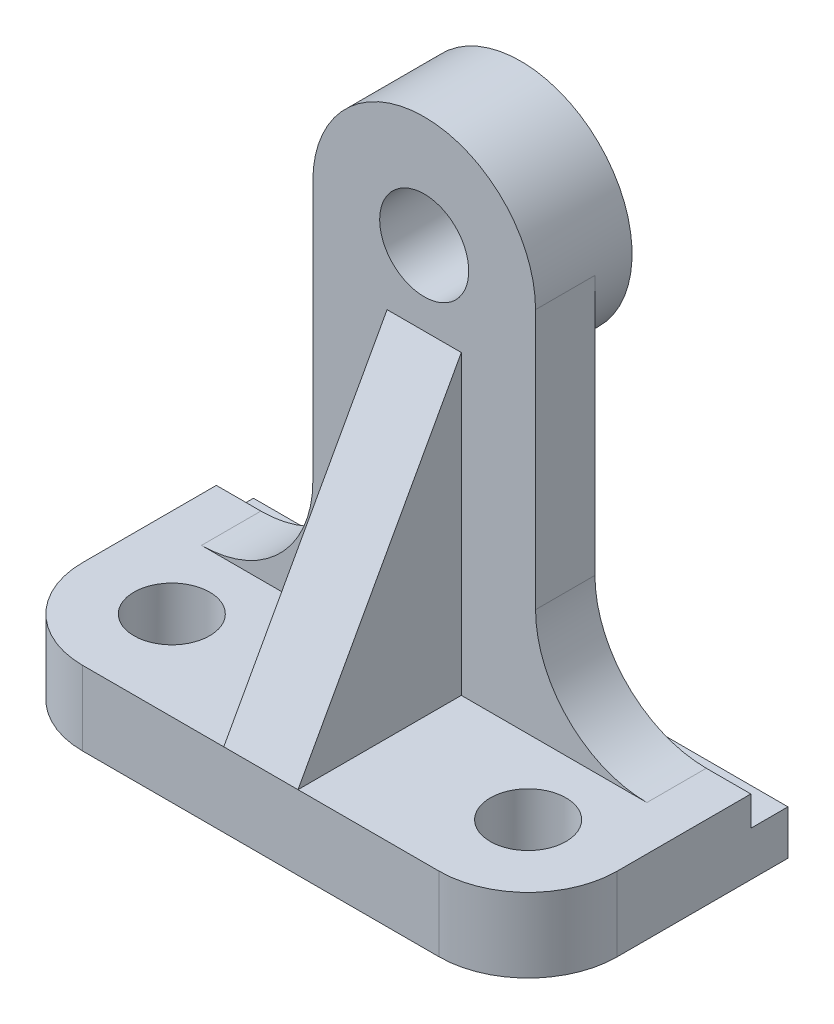
ISO-10303-21;
HEADER;
FILE_DESCRIPTION(('STEP AP214'),'2;1');
FILE_NAME('part.step','',(''),(''),'','','');
FILE_SCHEMA(('AUTOMOTIVE_DESIGN { 1 0 10303 214 1 1 1 1 }'));
ENDSEC;
DATA;
#1=APPLICATION_CONTEXT('core data for automotive mechanical design processes');
#2=APPLICATION_PROTOCOL_DEFINITION('international standard','automotive_design',2000,#1);
#3=PRODUCT_CONTEXT('',#1,'mechanical');
#4=PRODUCT('Part','Part','',(#3));
#5=PRODUCT_RELATED_PRODUCT_CATEGORY('part','',(#4));
#6=PRODUCT_DEFINITION_FORMATION('','',#4);
#7=PRODUCT_DEFINITION_CONTEXT('part definition',#1,'design');
#8=PRODUCT_DEFINITION('design','',#6,#7);
#9=PRODUCT_DEFINITION_SHAPE('','',#8);
#10=(LENGTH_UNIT() NAMED_UNIT(*) SI_UNIT(.MILLI.,.METRE.));
#11=(NAMED_UNIT(*) PLANE_ANGLE_UNIT() SI_UNIT($,.RADIAN.));
#12=(NAMED_UNIT(*) SI_UNIT($,.STERADIAN.) SOLID_ANGLE_UNIT());
#13=UNCERTAINTY_MEASURE_WITH_UNIT(LENGTH_MEASURE(1.E-05),#10,'distance_accuracy_value','');
#14=(GEOMETRIC_REPRESENTATION_CONTEXT(3) GLOBAL_UNCERTAINTY_ASSIGNED_CONTEXT((#13)) GLOBAL_UNIT_ASSIGNED_CONTEXT((#10,
#11,#12)) REPRESENTATION_CONTEXT('',''));
#15=CARTESIAN_POINT('',(0.,0.,0.));
#16=DIRECTION('',(0.,0.,1.));
#17=DIRECTION('',(1.,0.,0.));
#18=AXIS2_PLACEMENT_3D('',#15,#16,#17);
#19=CARTESIAN_POINT('',(0.,10.,0.));
#20=DIRECTION('',(0.,-1.,0.));
#21=DIRECTION('',(0.,0.,-1.));
#22=AXIS2_PLACEMENT_3D('',#19,#20,#21);
#23=PLANE('',#22);
#24=CARTESIAN_POINT('',(-24.,10.,5.50000000000001));
#25=DIRECTION('',(0.,1.,0.));
#26=DIRECTION('',(0.,0.,1.));
#27=AXIS2_PLACEMENT_3D('',#24,#25,#26);
#28=CIRCLE('',#27,5.09999999999999);
#29=CARTESIAN_POINT('',(-24.,10.,10.6));
#30=VERTEX_POINT('',#29);
#31=EDGE_CURVE('E414',#30,#30,#28,.T.);
#32=ORIENTED_EDGE('',*,*,#31,.F.);
#33=EDGE_LOOP('',(#32));
#34=FACE_BOUND('',#33,.T.);
#35=DIRECTION('',(0.,0.,1.));
#36=VECTOR('',#35,1.);
#37=CARTESIAN_POINT('',(-5.,10.,0.));
#38=LINE('',#37,#36);
#39=CARTESIAN_POINT('',(-5.,10.,-4.5));
#40=VERTEX_POINT('',#39);
#41=CARTESIAN_POINT('',(-5.,10.,17.5));
#42=VERTEX_POINT('',#41);
#43=EDGE_CURVE('E164',#40,#42,#38,.T.);
#44=ORIENTED_EDGE('',*,*,#43,.F.);
#45=DIRECTION('',(-1.,0.,0.));
#46=VECTOR('',#45,1.);
#47=CARTESIAN_POINT('',(-15.,10.,-4.5));
#48=LINE('',#47,#46);
#49=CARTESIAN_POINT('',(-30.,10.,-4.5));
#50=VERTEX_POINT('',#49);
#51=EDGE_CURVE('E298',#40,#50,#48,.T.);
#52=ORIENTED_EDGE('',*,*,#51,.T.);
#53=DIRECTION('',(0.,0.,-1.));
#54=VECTOR('',#53,1.);
#55=CARTESIAN_POINT('',(-30.,10.,0.));
#56=LINE('',#55,#54);
#57=CARTESIAN_POINT('',(-30.,10.,-12.5));
#58=VERTEX_POINT('',#57);
#59=EDGE_CURVE('E268',#50,#58,#56,.T.);
#60=ORIENTED_EDGE('',*,*,#59,.T.);
#61=DIRECTION('',(1.,0.,0.));
#62=VECTOR('',#61,1.);
#63=CARTESIAN_POINT('',(-36.,10.,-12.5));
#64=LINE('',#63,#62);
#65=CARTESIAN_POINT('',(-36.,10.,-12.5));
#66=VERTEX_POINT('',#65);
#67=EDGE_CURVE('E283',#66,#58,#64,.T.);
#68=ORIENTED_EDGE('',*,*,#67,.F.);
#69=DIRECTION('',(0.,0.,1.));
#70=VECTOR('',#69,1.);
#71=CARTESIAN_POINT('',(-36.,10.,17.5));
#72=LINE('',#71,#70);
#73=CARTESIAN_POINT('',(-36.,10.,5.50000000000001));
#74=VERTEX_POINT('',#73);
#75=EDGE_CURVE('E206',#66,#74,#72,.T.);
#76=ORIENTED_EDGE('',*,*,#75,.T.);
#77=CARTESIAN_POINT('',(-24.,10.,5.50000000000001));
#78=DIRECTION('',(0.,-1.,0.));
#79=DIRECTION('',(0.,0.,-1.));
#80=AXIS2_PLACEMENT_3D('',#77,#78,#79);
#81=CIRCLE('',#80,12.);
#82=CARTESIAN_POINT('',(-24.,10.,17.5));
#83=VERTEX_POINT('',#82);
#84=EDGE_CURVE('E197',#74,#83,#81,.F.);
#85=ORIENTED_EDGE('',*,*,#84,.T.);
#86=DIRECTION('',(1.,0.,0.));
#87=VECTOR('',#86,1.);
#88=CARTESIAN_POINT('',(-36.,10.,17.5));
#89=LINE('',#88,#87);
#90=EDGE_CURVE('E189',#83,#42,#89,.T.);
#91=ORIENTED_EDGE('',*,*,#90,.T.);
#92=EDGE_LOOP('',(#44,#52,#60,#68,#76,#85,#91));
#93=FACE_BOUND('',#92,.T.);
#94=ADVANCED_FACE('F45',(#34,#93),#23,.F.);
#95=CARTESIAN_POINT('',(-36.,10.,-12.5));
#96=DIRECTION('',(0.,0.,1.));
#97=DIRECTION('',(1.,0.,0.));
#98=AXIS2_PLACEMENT_3D('',#95,#96,#97);
#99=PLANE('',#98);
#100=DIRECTION('',(0.,-1.,0.));
#101=VECTOR('',#100,1.);
#102=CARTESIAN_POINT('',(36.,10.,-12.5));
#103=LINE('',#102,#101);
#104=CARTESIAN_POINT('',(36.,10.,-12.5));
#105=VERTEX_POINT('',#104);
#106=CARTESIAN_POINT('',(36.,6.,-12.5));
#107=VERTEX_POINT('',#106);
#108=EDGE_CURVE('E326',#105,#107,#103,.T.);
#109=ORIENTED_EDGE('',*,*,#108,.T.);
#110=DIRECTION('',(1.,0.,0.));
#111=VECTOR('',#110,1.);
#112=CARTESIAN_POINT('',(-36.,6.,-12.5));
#113=LINE('',#112,#111);
#114=CARTESIAN_POINT('',(-36.,6.,-12.5));
#115=VERTEX_POINT('',#114);
#116=EDGE_CURVE('E346',#115,#107,#113,.T.);
#117=ORIENTED_EDGE('',*,*,#116,.F.);
#118=DIRECTION('',(0.,-1.,0.));
#119=VECTOR('',#118,1.);
#120=CARTESIAN_POINT('',(-36.,10.,-12.5));
#121=LINE('',#120,#119);
#122=EDGE_CURVE('E329',#66,#115,#121,.T.);
#123=ORIENTED_EDGE('',*,*,#122,.F.);
#124=ORIENTED_EDGE('',*,*,#67,.T.);
#125=CARTESIAN_POINT('',(-30.,25.,-12.5));
#126=DIRECTION('',(0.,0.,1.));
#127=DIRECTION('',(1.,0.,0.));
#128=AXIS2_PLACEMENT_3D('',#125,#126,#127);
#129=CIRCLE('',#128,15.);
#130=CARTESIAN_POINT('',(-15.,25.,-12.5));
#131=VERTEX_POINT('',#130);
#132=EDGE_CURVE('E54',#58,#131,#129,.T.);
#133=ORIENTED_EDGE('',*,*,#132,.T.);
#134=DIRECTION('',(0.,1.,0.));
#135=VECTOR('',#134,1.);
#136=CARTESIAN_POINT('',(-15.,60.,-12.5));
#137=LINE('',#136,#135);
#138=CARTESIAN_POINT('',(-15.,60.,-12.5));
#139=VERTEX_POINT('',#138);
#140=EDGE_CURVE('E280',#131,#139,#137,.T.);
#141=ORIENTED_EDGE('',*,*,#140,.T.);
#142=CARTESIAN_POINT('',(0.,60.,-12.5));
#143=DIRECTION('',(0.,0.,-1.));
#144=DIRECTION('',(-1.,0.,0.));
#145=AXIS2_PLACEMENT_3D('',#142,#143,#144);
#146=CIRCLE('',#145,15.);
#147=CARTESIAN_POINT('',(15.,60.,-12.5));
#148=VERTEX_POINT('',#147);
#149=EDGE_CURVE('E395',#148,#139,#146,.T.);
#150=ORIENTED_EDGE('',*,*,#149,.F.);
#151=DIRECTION('',(0.,-1.,0.));
#152=VECTOR('',#151,1.);
#153=CARTESIAN_POINT('',(15.,10.,-12.5));
#154=LINE('',#153,#152);
#155=CARTESIAN_POINT('',(15.,25.,-12.5));
#156=VERTEX_POINT('',#155);
#157=EDGE_CURVE('E290',#148,#156,#154,.T.);
#158=ORIENTED_EDGE('',*,*,#157,.T.);
#159=CARTESIAN_POINT('',(30.,25.,-12.5));
#160=DIRECTION('',(0.,0.,1.));
#161=DIRECTION('',(1.,0.,0.));
#162=AXIS2_PLACEMENT_3D('',#159,#160,#161);
#163=CIRCLE('',#162,15.);
#164=CARTESIAN_POINT('',(30.,10.,-12.5));
#165=VERTEX_POINT('',#164);
#166=EDGE_CURVE('E262',#156,#165,#163,.T.);
#167=ORIENTED_EDGE('',*,*,#166,.T.);
#168=EDGE_CURVE('E338',#165,#105,#64,.T.);
#169=ORIENTED_EDGE('',*,*,#168,.T.);
#170=EDGE_LOOP('',(#109,#117,#123,#124,#133,#141,#150,#158,#167,#169));
#171=FACE_BOUND('',#170,.T.);
#172=ADVANCED_FACE('F278',(#171),#99,.F.);
#173=CARTESIAN_POINT('',(30.,10.,-4.5));
#174=VERTEX_POINT('',#173);
#175=CARTESIAN_POINT('',(5.,10.,-4.5));
#176=VERTEX_POINT('',#175);
#177=EDGE_CURVE('E318',#174,#176,#48,.T.);
#178=ORIENTED_EDGE('',*,*,#177,.T.);
#179=DIRECTION('',(0.,0.,1.));
#180=VECTOR('',#179,1.);
#181=CARTESIAN_POINT('',(5.,10.,0.));
#182=LINE('',#181,#180);
#183=CARTESIAN_POINT('',(5.,10.,17.5));
#184=VERTEX_POINT('',#183);
#185=EDGE_CURVE('E664',#176,#184,#182,.T.);
#186=ORIENTED_EDGE('',*,*,#185,.T.);
#187=CARTESIAN_POINT('',(24.,10.,17.5));
#188=VERTEX_POINT('',#187);
#189=EDGE_CURVE('E192',#184,#188,#89,.T.);
#190=ORIENTED_EDGE('',*,*,#189,.T.);
#191=CARTESIAN_POINT('',(24.,10.,5.50000000000001));
#192=DIRECTION('',(0.,-1.,0.));
#193=DIRECTION('',(0.,0.,-1.));
#194=AXIS2_PLACEMENT_3D('',#191,#192,#193);
#195=CIRCLE('',#194,12.);
#196=CARTESIAN_POINT('',(36.,10.,5.50000000000001));
#197=VERTEX_POINT('',#196);
#198=EDGE_CURVE('E247',#188,#197,#195,.F.);
#199=ORIENTED_EDGE('',*,*,#198,.T.);
#200=DIRECTION('',(0.,0.,-1.));
#201=VECTOR('',#200,1.);
#202=CARTESIAN_POINT('',(36.,10.,17.5));
#203=LINE('',#202,#201);
#204=EDGE_CURVE('E224',#197,#105,#203,.T.);
#205=ORIENTED_EDGE('',*,*,#204,.T.);
#206=ORIENTED_EDGE('',*,*,#168,.F.);
#207=DIRECTION('',(0.,0.,-1.));
#208=VECTOR('',#207,1.);
#209=CARTESIAN_POINT('',(30.,10.,0.));
#210=LINE('',#209,#208);
#211=EDGE_CURVE('E258',#165,#174,#210,.F.);
#212=ORIENTED_EDGE('',*,*,#211,.T.);
#213=EDGE_LOOP('',(#178,#186,#190,#199,#205,#206,#212));
#214=FACE_BOUND('',#213,.T.);
#215=CARTESIAN_POINT('',(24.,10.,5.50000000000001));
#216=DIRECTION('',(0.,1.,0.));
#217=DIRECTION('',(0.,0.,1.));
#218=AXIS2_PLACEMENT_3D('',#215,#216,#217);
#219=CIRCLE('',#218,5.09999999999999);
#220=CARTESIAN_POINT('',(24.,10.,10.6));
#221=VERTEX_POINT('',#220);
#222=EDGE_CURVE('E402',#221,#221,#219,.T.);
#223=ORIENTED_EDGE('',*,*,#222,.F.);
#224=EDGE_LOOP('',(#223));
#225=FACE_BOUND('',#224,.T.);
#226=ADVANCED_FACE('F374',(#214,#225),#23,.F.);
#227=CARTESIAN_POINT('',(36.,10.,17.5));
#228=DIRECTION('',(-1.,0.,0.));
#229=DIRECTION('',(0.,0.,1.));
#230=AXIS2_PLACEMENT_3D('',#227,#228,#229);
#231=PLANE('',#230);
#232=DIRECTION('',(0.,-1.,0.));
#233=VECTOR('',#232,1.);
#234=CARTESIAN_POINT('',(36.,10.,-17.5));
#235=LINE('',#234,#233);
#236=CARTESIAN_POINT('',(36.,6.,-17.5));
#237=VERTEX_POINT('',#236);
#238=CARTESIAN_POINT('',(36.,0.,-17.5));
#239=VERTEX_POINT('',#238);
#240=EDGE_CURVE('E204',#237,#239,#235,.T.);
#241=ORIENTED_EDGE('',*,*,#240,.F.);
#242=DIRECTION('',(0.,0.,-1.));
#243=VECTOR('',#242,1.);
#244=CARTESIAN_POINT('',(36.,6.,-17.5));
#245=LINE('',#244,#243);
#246=EDGE_CURVE('E334',#107,#237,#245,.T.);
#247=ORIENTED_EDGE('',*,*,#246,.F.);
#248=ORIENTED_EDGE('',*,*,#108,.F.);
#249=ORIENTED_EDGE('',*,*,#204,.F.);
#250=DIRECTION('',(0.,-1.,0.));
#251=VECTOR('',#250,1.);
#252=CARTESIAN_POINT('',(36.,10.,5.50000000000001));
#253=LINE('',#252,#251);
#254=CARTESIAN_POINT('',(36.,0.,5.50000000000001));
#255=VERTEX_POINT('',#254);
#256=EDGE_CURVE('E228',#197,#255,#253,.T.);
#257=ORIENTED_EDGE('',*,*,#256,.T.);
#258=DIRECTION('',(0.,0.,-1.));
#259=VECTOR('',#258,1.);
#260=CARTESIAN_POINT('',(36.,0.,17.5));
#261=LINE('',#260,#259);
#262=EDGE_CURVE('E210',#255,#239,#261,.T.);
#263=ORIENTED_EDGE('',*,*,#262,.T.);
#264=EDGE_LOOP('',(#241,#247,#248,#249,#257,#263));
#265=FACE_BOUND('',#264,.T.);
#266=ADVANCED_FACE('F380',(#265),#231,.F.);
#267=CARTESIAN_POINT('',(-36.,10.,-17.5));
#268=DIRECTION('',(0.,0.,1.));
#269=DIRECTION('',(1.,0.,0.));
#270=AXIS2_PLACEMENT_3D('',#267,#268,#269);
#271=PLANE('',#270);
#272=DIRECTION('',(-1.,0.,0.));
#273=VECTOR('',#272,1.);
#274=CARTESIAN_POINT('',(-36.,0.,-17.5));
#275=LINE('',#274,#273);
#276=CARTESIAN_POINT('',(-36.,0.,-17.5));
#277=VERTEX_POINT('',#276);
#278=EDGE_CURVE('E214',#239,#277,#275,.T.);
#279=ORIENTED_EDGE('',*,*,#278,.T.);
#280=DIRECTION('',(0.,-1.,0.));
#281=VECTOR('',#280,1.);
#282=CARTESIAN_POINT('',(-36.,10.,-17.5));
#283=LINE('',#282,#281);
#284=CARTESIAN_POINT('',(-36.,6.,-17.5));
#285=VERTEX_POINT('',#284);
#286=EDGE_CURVE('E199',#285,#277,#283,.T.);
#287=ORIENTED_EDGE('',*,*,#286,.F.);
#288=DIRECTION('',(1.,0.,0.));
#289=VECTOR('',#288,1.);
#290=CARTESIAN_POINT('',(-36.,6.,-17.5));
#291=LINE('',#290,#289);
#292=EDGE_CURVE('E215',#285,#237,#291,.T.);
#293=ORIENTED_EDGE('',*,*,#292,.T.);
#294=ORIENTED_EDGE('',*,*,#240,.T.);
#295=EDGE_LOOP('',(#279,#287,#293,#294));
#296=FACE_BOUND('',#295,.T.);
#297=ADVANCED_FACE('F449',(#296),#271,.F.);
#298=CARTESIAN_POINT('',(-36.,10.,17.5));
#299=DIRECTION('',(1.,0.,0.));
#300=DIRECTION('',(0.,0.,-1.));
#301=AXIS2_PLACEMENT_3D('',#298,#299,#300);
#302=PLANE('',#301);
#303=ORIENTED_EDGE('',*,*,#122,.T.);
#304=DIRECTION('',(0.,0.,-1.));
#305=VECTOR('',#304,1.);
#306=CARTESIAN_POINT('',(-36.,6.,-17.5));
#307=LINE('',#306,#305);
#308=EDGE_CURVE('E333',#115,#285,#307,.T.);
#309=ORIENTED_EDGE('',*,*,#308,.T.);
#310=ORIENTED_EDGE('',*,*,#286,.T.);
#311=DIRECTION('',(0.,0.,1.));
#312=VECTOR('',#311,1.);
#313=CARTESIAN_POINT('',(-36.,0.,17.5));
#314=LINE('',#313,#312);
#315=CARTESIAN_POINT('',(-36.,0.,5.50000000000001));
#316=VERTEX_POINT('',#315);
#317=EDGE_CURVE('E218',#277,#316,#314,.T.);
#318=ORIENTED_EDGE('',*,*,#317,.T.);
#319=DIRECTION('',(0.,-1.,0.));
#320=VECTOR('',#319,1.);
#321=CARTESIAN_POINT('',(-36.,10.,5.50000000000001));
#322=LINE('',#321,#320);
#323=EDGE_CURVE('E250',#316,#74,#322,.F.);
#324=ORIENTED_EDGE('',*,*,#323,.T.);
#325=ORIENTED_EDGE('',*,*,#75,.F.);
#326=EDGE_LOOP('',(#303,#309,#310,#318,#324,#325));
#327=FACE_BOUND('',#326,.T.);
#328=ADVANCED_FACE('F359',(#327),#302,.F.);
#329=CARTESIAN_POINT('',(-36.,10.,17.5));
#330=DIRECTION('',(0.,0.,-1.));
#331=DIRECTION('',(-1.,0.,0.));
#332=AXIS2_PLACEMENT_3D('',#329,#330,#331);
#333=PLANE('',#332);
#334=ORIENTED_EDGE('',*,*,#189,.F.);
#335=DIRECTION('',(-1.,0.,0.));
#336=VECTOR('',#335,1.);
#337=CARTESIAN_POINT('',(-36.,10.,17.5));
#338=LINE('',#337,#336);
#339=EDGE_CURVE('E178',#42,#184,#338,.F.);
#340=ORIENTED_EDGE('',*,*,#339,.F.);
#341=ORIENTED_EDGE('',*,*,#90,.F.);
#342=DIRECTION('',(0.,-1.,0.));
#343=VECTOR('',#342,1.);
#344=CARTESIAN_POINT('',(-24.,10.,17.5));
#345=LINE('',#344,#343);
#346=CARTESIAN_POINT('',(-24.,0.,17.5));
#347=VERTEX_POINT('',#346);
#348=EDGE_CURVE('E239',#83,#347,#345,.T.);
#349=ORIENTED_EDGE('',*,*,#348,.T.);
#350=DIRECTION('',(1.,0.,0.));
#351=VECTOR('',#350,1.);
#352=CARTESIAN_POINT('',(-36.,0.,17.5));
#353=LINE('',#352,#351);
#354=CARTESIAN_POINT('',(24.,0.,17.5));
#355=VERTEX_POINT('',#354);
#356=EDGE_CURVE('E222',#347,#355,#353,.T.);
#357=ORIENTED_EDGE('',*,*,#356,.T.);
#358=DIRECTION('',(0.,-1.,0.));
#359=VECTOR('',#358,1.);
#360=CARTESIAN_POINT('',(24.,10.,17.5));
#361=LINE('',#360,#359);
#362=EDGE_CURVE('E242',#355,#188,#361,.F.);
#363=ORIENTED_EDGE('',*,*,#362,.T.);
#364=EDGE_LOOP('',(#334,#340,#341,#349,#357,#363));
#365=FACE_BOUND('',#364,.T.);
#366=ADVANCED_FACE('F187',(#365),#333,.F.);
#367=CARTESIAN_POINT('',(0.,0.,0.));
#368=DIRECTION('',(0.,-1.,0.));
#369=DIRECTION('',(0.,0.,-1.));
#370=AXIS2_PLACEMENT_3D('',#367,#368,#369);
#371=PLANE('',#370);
#372=CARTESIAN_POINT('',(24.,0.,5.50000000000001));
#373=DIRECTION('',(0.,-1.,0.));
#374=DIRECTION('',(0.,0.,-1.));
#375=AXIS2_PLACEMENT_3D('',#372,#373,#374);
#376=CIRCLE('',#375,12.);
#377=EDGE_CURVE('E235',#255,#355,#376,.T.);
#378=ORIENTED_EDGE('',*,*,#377,.T.);
#379=ORIENTED_EDGE('',*,*,#356,.F.);
#380=CARTESIAN_POINT('',(-24.,0.,5.50000000000001));
#381=DIRECTION('',(0.,-1.,0.));
#382=DIRECTION('',(0.,0.,-1.));
#383=AXIS2_PLACEMENT_3D('',#380,#381,#382);
#384=CIRCLE('',#383,12.);
#385=EDGE_CURVE('E232',#347,#316,#384,.T.);
#386=ORIENTED_EDGE('',*,*,#385,.T.);
#387=ORIENTED_EDGE('',*,*,#317,.F.);
#388=ORIENTED_EDGE('',*,*,#278,.F.);
#389=ORIENTED_EDGE('',*,*,#262,.F.);
#390=EDGE_LOOP('',(#378,#379,#386,#387,#388,#389));
#391=FACE_BOUND('',#390,.T.);
#392=CARTESIAN_POINT('',(24.,0.,5.50000000000001));
#393=DIRECTION('',(0.,-1.,0.));
#394=DIRECTION('',(0.,0.,-1.));
#395=AXIS2_PLACEMENT_3D('',#392,#393,#394);
#396=CIRCLE('',#395,5.09999999999999);
#397=CARTESIAN_POINT('',(24.,0.,0.400000000000013));
#398=VERTEX_POINT('',#397);
#399=EDGE_CURVE('E410',#398,#398,#396,.T.);
#400=ORIENTED_EDGE('',*,*,#399,.F.);
#401=EDGE_LOOP('',(#400));
#402=FACE_BOUND('',#401,.T.);
#403=CARTESIAN_POINT('',(-24.,0.,5.50000000000001));
#404=DIRECTION('',(0.,-1.,0.));
#405=DIRECTION('',(0.,0.,-1.));
#406=AXIS2_PLACEMENT_3D('',#403,#404,#405);
#407=CIRCLE('',#406,5.09999999999999);
#408=CARTESIAN_POINT('',(-24.,0.,0.400000000000013));
#409=VERTEX_POINT('',#408);
#410=EDGE_CURVE('E417',#409,#409,#407,.T.);
#411=ORIENTED_EDGE('',*,*,#410,.F.);
#412=EDGE_LOOP('',(#411));
#413=FACE_BOUND('',#412,.T.);
#414=ADVANCED_FACE('F365',(#391,#402,#413),#371,.T.);
#415=CARTESIAN_POINT('',(24.,10.,5.50000000000001));
#416=DIRECTION('',(0.,-1.,0.));
#417=DIRECTION('',(0.,0.,-1.));
#418=AXIS2_PLACEMENT_3D('',#415,#416,#417);
#419=CYLINDRICAL_SURFACE('',#418,12.);
#420=ORIENTED_EDGE('',*,*,#198,.F.);
#421=ORIENTED_EDGE('',*,*,#362,.F.);
#422=ORIENTED_EDGE('',*,*,#377,.F.);
#423=ORIENTED_EDGE('',*,*,#256,.F.);
#424=EDGE_LOOP('',(#420,#421,#422,#423));
#425=FACE_BOUND('',#424,.T.);
#426=ADVANCED_FACE('F373',(#425),#419,.T.);
#427=CARTESIAN_POINT('',(-24.,10.,5.50000000000001));
#428=DIRECTION('',(0.,-1.,0.));
#429=DIRECTION('',(0.,0.,-1.));
#430=AXIS2_PLACEMENT_3D('',#427,#428,#429);
#431=CYLINDRICAL_SURFACE('',#430,12.);
#432=ORIENTED_EDGE('',*,*,#84,.F.);
#433=ORIENTED_EDGE('',*,*,#323,.F.);
#434=ORIENTED_EDGE('',*,*,#385,.F.);
#435=ORIENTED_EDGE('',*,*,#348,.F.);
#436=EDGE_LOOP('',(#432,#433,#434,#435));
#437=FACE_BOUND('',#436,.T.);
#438=ADVANCED_FACE('F362',(#437),#431,.T.);
#439=CARTESIAN_POINT('',(-36.,6.,-17.5));
#440=DIRECTION('',(0.,-1.,0.));
#441=DIRECTION('',(0.,0.,-1.));
#442=AXIS2_PLACEMENT_3D('',#439,#440,#441);
#443=PLANE('',#442);
#444=ORIENTED_EDGE('',*,*,#246,.T.);
#445=ORIENTED_EDGE('',*,*,#292,.F.);
#446=ORIENTED_EDGE('',*,*,#308,.F.);
#447=ORIENTED_EDGE('',*,*,#116,.T.);
#448=EDGE_LOOP('',(#444,#445,#446,#447));
#449=FACE_BOUND('',#448,.T.);
#450=ADVANCED_FACE('F461',(#449),#443,.F.);
#451=CARTESIAN_POINT('',(-15.,60.,-4.5));
#452=DIRECTION('',(-1.,0.,0.));
#453=DIRECTION('',(0.,-1.,0.));
#454=AXIS2_PLACEMENT_3D('',#451,#452,#453);
#455=PLANE('',#454);
#456=ORIENTED_EDGE('',*,*,#140,.F.);
#457=DIRECTION('',(0.,0.,-1.));
#458=VECTOR('',#457,1.);
#459=CARTESIAN_POINT('',(-15.,25.,-4.5));
#460=LINE('',#459,#458);
#461=CARTESIAN_POINT('',(-15.,25.,-4.5));
#462=VERTEX_POINT('',#461);
#463=EDGE_CURVE('E69',#131,#462,#460,.F.);
#464=ORIENTED_EDGE('',*,*,#463,.T.);
#465=DIRECTION('',(0.,1.,0.));
#466=VECTOR('',#465,1.);
#467=CARTESIAN_POINT('',(-15.,60.,-4.5));
#468=LINE('',#467,#466);
#469=CARTESIAN_POINT('',(-15.,60.,-4.5));
#470=VERTEX_POINT('',#469);
#471=EDGE_CURVE('E300',#462,#470,#468,.T.);
#472=ORIENTED_EDGE('',*,*,#471,.T.);
#473=DIRECTION('',(0.,0.,-1.));
#474=VECTOR('',#473,1.);
#475=CARTESIAN_POINT('',(-15.,60.,-4.5));
#476=LINE('',#475,#474);
#477=EDGE_CURVE('E288',#470,#139,#476,.T.);
#478=ORIENTED_EDGE('',*,*,#477,.T.);
#479=EDGE_LOOP('',(#456,#464,#472,#478));
#480=FACE_BOUND('',#479,.T.);
#481=ADVANCED_FACE('F286',(#480),#455,.T.);
#482=CARTESIAN_POINT('',(15.,10.,-4.5));
#483=DIRECTION('',(1.,0.,0.));
#484=DIRECTION('',(0.,0.,-1.));
#485=AXIS2_PLACEMENT_3D('',#482,#483,#484);
#486=PLANE('',#485);
#487=DIRECTION('',(0.,-1.,0.));
#488=VECTOR('',#487,1.);
#489=CARTESIAN_POINT('',(15.,10.,-4.5));
#490=LINE('',#489,#488);
#491=CARTESIAN_POINT('',(15.,60.,-4.5));
#492=VERTEX_POINT('',#491);
#493=CARTESIAN_POINT('',(15.,25.,-4.5));
#494=VERTEX_POINT('',#493);
#495=EDGE_CURVE('E308',#492,#494,#490,.T.);
#496=ORIENTED_EDGE('',*,*,#495,.T.);
#497=DIRECTION('',(0.,0.,-1.));
#498=VECTOR('',#497,1.);
#499=CARTESIAN_POINT('',(15.,25.,-4.5));
#500=LINE('',#499,#498);
#501=EDGE_CURVE('E254',#494,#156,#500,.T.);
#502=ORIENTED_EDGE('',*,*,#501,.T.);
#503=ORIENTED_EDGE('',*,*,#157,.F.);
#504=DIRECTION('',(0.,0.,-1.));
#505=VECTOR('',#504,1.);
#506=CARTESIAN_POINT('',(15.,60.,-4.5));
#507=LINE('',#506,#505);
#508=EDGE_CURVE('E322',#492,#148,#507,.T.);
#509=ORIENTED_EDGE('',*,*,#508,.F.);
#510=EDGE_LOOP('',(#496,#502,#503,#509));
#511=FACE_BOUND('',#510,.T.);
#512=ADVANCED_FACE('F391',(#511),#486,.T.);
#513=CARTESIAN_POINT('',(0.,60.,-4.5));
#514=DIRECTION('',(0.,0.,-1.));
#515=DIRECTION('',(-1.,0.,0.));
#516=AXIS2_PLACEMENT_3D('',#513,#514,#515);
#517=CYLINDRICAL_SURFACE('',#516,15.);
#518=ORIENTED_EDGE('',*,*,#149,.T.);
#519=ORIENTED_EDGE('',*,*,#477,.F.);
#520=CARTESIAN_POINT('',(0.,60.,-4.5));
#521=DIRECTION('',(0.,0.,-1.));
#522=DIRECTION('',(1.,0.,0.));
#523=AXIS2_PLACEMENT_3D('',#520,#521,#522);
#524=CIRCLE('',#523,15.);
#525=EDGE_CURVE('E303',#470,#492,#524,.T.);
#526=ORIENTED_EDGE('',*,*,#525,.T.);
#527=ORIENTED_EDGE('',*,*,#508,.T.);
#528=EDGE_LOOP('',(#518,#519,#526,#527));
#529=FACE_BOUND('',#528,.T.);
#530=CARTESIAN_POINT('',(0.,60.,-17.5));
#531=DIRECTION('',(0.,0.,-1.));
#532=DIRECTION('',(-1.,0.,0.));
#533=AXIS2_PLACEMENT_3D('',#530,#531,#532);
#534=CIRCLE('',#533,15.);
#535=CARTESIAN_POINT('',(-15.,60.,-17.5));
#536=VERTEX_POINT('',#535);
#537=EDGE_CURVE('E397',#536,#536,#534,.T.);
#538=ORIENTED_EDGE('',*,*,#537,.F.);
#539=EDGE_LOOP('',(#538));
#540=FACE_BOUND('',#539,.T.);
#541=ADVANCED_FACE('F393',(#529,#540),#517,.T.);
#542=CARTESIAN_POINT('',(0.,60.,-4.5));
#543=DIRECTION('',(0.,0.,1.));
#544=DIRECTION('',(1.,0.,0.));
#545=AXIS2_PLACEMENT_3D('',#542,#543,#544);
#546=PLANE('',#545);
#547=DIRECTION('',(0.,1.,0.));
#548=VECTOR('',#547,1.);
#549=CARTESIAN_POINT('',(5.,60.,-4.5));
#550=LINE('',#549,#548);
#551=CARTESIAN_POINT('',(5.,50.,-4.5));
#552=VERTEX_POINT('',#551);
#553=EDGE_CURVE('E665',#176,#552,#550,.T.);
#554=ORIENTED_EDGE('',*,*,#553,.F.);
#555=ORIENTED_EDGE('',*,*,#177,.F.);
#556=CARTESIAN_POINT('',(30.,25.,-4.5));
#557=DIRECTION('',(0.,0.,1.));
#558=DIRECTION('',(1.,0.,0.));
#559=AXIS2_PLACEMENT_3D('',#556,#557,#558);
#560=CIRCLE('',#559,15.);
#561=EDGE_CURVE('E265',#174,#494,#560,.F.);
#562=ORIENTED_EDGE('',*,*,#561,.T.);
#563=ORIENTED_EDGE('',*,*,#495,.F.);
#564=ORIENTED_EDGE('',*,*,#525,.F.);
#565=ORIENTED_EDGE('',*,*,#471,.F.);
#566=CARTESIAN_POINT('',(-30.,25.,-4.5));
#567=DIRECTION('',(0.,0.,1.));
#568=DIRECTION('',(1.,0.,0.));
#569=AXIS2_PLACEMENT_3D('',#566,#567,#568);
#570=CIRCLE('',#569,15.);
#571=EDGE_CURVE('E11',#462,#50,#570,.F.);
#572=ORIENTED_EDGE('',*,*,#571,.T.);
#573=ORIENTED_EDGE('',*,*,#51,.F.);
#574=DIRECTION('',(0.,1.,0.));
#575=VECTOR('',#574,1.);
#576=CARTESIAN_POINT('',(-5.,60.,-4.5));
#577=LINE('',#576,#575);
#578=CARTESIAN_POINT('',(-5.,50.,-4.5));
#579=VERTEX_POINT('',#578);
#580=EDGE_CURVE('E167',#40,#579,#577,.T.);
#581=ORIENTED_EDGE('',*,*,#580,.T.);
#582=DIRECTION('',(1.,0.,0.));
#583=VECTOR('',#582,1.);
#584=CARTESIAN_POINT('',(0.,50.,-4.5));
#585=LINE('',#584,#583);
#586=EDGE_CURVE('E181',#552,#579,#585,.F.);
#587=ORIENTED_EDGE('',*,*,#586,.F.);
#588=EDGE_LOOP('',(#554,#555,#562,#563,#564,#565,#572,#573,#581,#587));
#589=FACE_BOUND('',#588,.T.);
#590=CARTESIAN_POINT('',(0.,60.,-4.5));
#591=DIRECTION('',(0.,0.,-1.));
#592=DIRECTION('',(-1.,0.,0.));
#593=AXIS2_PLACEMENT_3D('',#590,#591,#592);
#594=CIRCLE('',#593,6.);
#595=CARTESIAN_POINT('',(-6.,60.,-4.5));
#596=VERTEX_POINT('',#595);
#597=EDGE_CURVE('E291',#596,#596,#594,.T.);
#598=ORIENTED_EDGE('',*,*,#597,.T.);
#599=EDGE_LOOP('',(#598));
#600=FACE_BOUND('',#599,.T.);
#601=ADVANCED_FACE('F296',(#589,#600),#546,.T.);
#602=CARTESIAN_POINT('',(0.,60.,-4.5));
#603=DIRECTION('',(0.,0.,-1.));
#604=DIRECTION('',(-1.,0.,0.));
#605=AXIS2_PLACEMENT_3D('',#602,#603,#604);
#606=CYLINDRICAL_SURFACE('',#605,6.);
#607=CARTESIAN_POINT('',(0.,60.,-17.5));
#608=DIRECTION('',(0.,0.,-1.));
#609=DIRECTION('',(-1.,0.,0.));
#610=AXIS2_PLACEMENT_3D('',#607,#608,#609);
#611=CIRCLE('',#610,6.);
#612=CARTESIAN_POINT('',(-6.,60.,-17.5));
#613=VERTEX_POINT('',#612);
#614=EDGE_CURVE('E194',#613,#613,#611,.T.);
#615=ORIENTED_EDGE('',*,*,#614,.T.);
#616=EDGE_LOOP('',(#615));
#617=FACE_BOUND('',#616,.T.);
#618=ORIENTED_EDGE('',*,*,#597,.F.);
#619=EDGE_LOOP('',(#618));
#620=FACE_BOUND('',#619,.T.);
#621=ADVANCED_FACE('F426',(#617,#620),#606,.F.);
#622=CARTESIAN_POINT('',(30.,25.,-4.5));
#623=DIRECTION('',(0.,0.,-1.));
#624=DIRECTION('',(-1.,0.,0.));
#625=AXIS2_PLACEMENT_3D('',#622,#623,#624);
#626=CYLINDRICAL_SURFACE('',#625,15.);
#627=ORIENTED_EDGE('',*,*,#561,.F.);
#628=ORIENTED_EDGE('',*,*,#211,.F.);
#629=ORIENTED_EDGE('',*,*,#166,.F.);
#630=ORIENTED_EDGE('',*,*,#501,.F.);
#631=EDGE_LOOP('',(#627,#628,#629,#630));
#632=FACE_BOUND('',#631,.T.);
#633=ADVANCED_FACE('F388',(#632),#626,.F.);
#634=CARTESIAN_POINT('',(-30.,25.,0.));
#635=DIRECTION('',(0.,0.,-1.));
#636=DIRECTION('',(-1.,0.,0.));
#637=AXIS2_PLACEMENT_3D('',#634,#635,#636);
#638=CYLINDRICAL_SURFACE('',#637,15.);
#639=ORIENTED_EDGE('',*,*,#571,.F.);
#640=ORIENTED_EDGE('',*,*,#463,.F.);
#641=ORIENTED_EDGE('',*,*,#132,.F.);
#642=ORIENTED_EDGE('',*,*,#59,.F.);
#643=EDGE_LOOP('',(#639,#640,#641,#642));
#644=FACE_BOUND('',#643,.T.);
#645=ADVANCED_FACE('F47',(#644),#638,.F.);
#646=CARTESIAN_POINT('',(-24.,10.,5.50000000000001));
#647=DIRECTION('',(0.,1.,0.));
#648=DIRECTION('',(0.,0.,1.));
#649=AXIS2_PLACEMENT_3D('',#646,#647,#648);
#650=CYLINDRICAL_SURFACE('',#649,5.09999999999999);
#651=ORIENTED_EDGE('',*,*,#31,.T.);
#652=EDGE_LOOP('',(#651));
#653=FACE_BOUND('',#652,.T.);
#654=ORIENTED_EDGE('',*,*,#410,.T.);
#655=EDGE_LOOP('',(#654));
#656=FACE_BOUND('',#655,.T.);
#657=ADVANCED_FACE('F539',(#653,#656),#650,.F.);
#658=CARTESIAN_POINT('',(24.,10.,5.50000000000001));
#659=DIRECTION('',(0.,1.,0.));
#660=DIRECTION('',(0.,0.,1.));
#661=AXIS2_PLACEMENT_3D('',#658,#659,#660);
#662=CYLINDRICAL_SURFACE('',#661,5.09999999999999);
#663=ORIENTED_EDGE('',*,*,#222,.T.);
#664=EDGE_LOOP('',(#663));
#665=FACE_BOUND('',#664,.T.);
#666=ORIENTED_EDGE('',*,*,#399,.T.);
#667=EDGE_LOOP('',(#666));
#668=FACE_BOUND('',#667,.T.);
#669=ADVANCED_FACE('F505',(#665,#668),#662,.F.);
#670=CARTESIAN_POINT('',(0.,60.,-17.5));
#671=DIRECTION('',(0.,0.,-1.));
#672=DIRECTION('',(-1.,0.,0.));
#673=AXIS2_PLACEMENT_3D('',#670,#671,#672);
#674=PLANE('',#673);
#675=ORIENTED_EDGE('',*,*,#614,.F.);
#676=EDGE_LOOP('',(#675));
#677=FACE_BOUND('',#676,.T.);
#678=ORIENTED_EDGE('',*,*,#537,.T.);
#679=EDGE_LOOP('',(#678));
#680=FACE_BOUND('',#679,.T.);
#681=ADVANCED_FACE('F501',(#677,#680),#674,.T.);
#682=CARTESIAN_POINT('',(0.,10.,17.5));
#683=DIRECTION('',(0.,-0.481918749772156,-0.876215908676647));
#684=DIRECTION('',(0.,0.876215908676647,-0.481918749772156));
#685=AXIS2_PLACEMENT_3D('',#682,#683,#684);
#686=PLANE('',#685);
#687=DIRECTION('',(0.,0.876215908676647,-0.481918749772156));
#688=VECTOR('',#687,1.);
#689=CARTESIAN_POINT('',(-5.,10.,17.5));
#690=LINE('',#689,#688);
#691=EDGE_CURVE('E61',#42,#579,#690,.T.);
#692=ORIENTED_EDGE('',*,*,#691,.F.);
#693=ORIENTED_EDGE('',*,*,#339,.T.);
#694=DIRECTION('',(0.,0.876215908676647,-0.481918749772156));
#695=VECTOR('',#694,1.);
#696=CARTESIAN_POINT('',(5.,10.,17.5));
#697=LINE('',#696,#695);
#698=EDGE_CURVE('E172',#184,#552,#697,.T.);
#699=ORIENTED_EDGE('',*,*,#698,.T.);
#700=ORIENTED_EDGE('',*,*,#586,.T.);
#701=EDGE_LOOP('',(#692,#693,#699,#700));
#702=FACE_BOUND('',#701,.T.);
#703=ADVANCED_FACE('F176',(#702),#686,.F.);
#704=CARTESIAN_POINT('',(5.,37.5,0.));
#705=DIRECTION('',(1.,0.,0.));
#706=DIRECTION('',(0.,0.,-1.));
#707=AXIS2_PLACEMENT_3D('',#704,#705,#706);
#708=PLANE('',#707);
#709=ORIENTED_EDGE('',*,*,#185,.F.);
#710=ORIENTED_EDGE('',*,*,#553,.T.);
#711=ORIENTED_EDGE('',*,*,#698,.F.);
#712=EDGE_LOOP('',(#709,#710,#711));
#713=FACE_BOUND('',#712,.T.);
#714=ADVANCED_FACE('F517',(#713),#708,.T.);
#715=CARTESIAN_POINT('',(-5.,37.5,0.));
#716=DIRECTION('',(1.,0.,0.));
#717=DIRECTION('',(0.,0.,-1.));
#718=AXIS2_PLACEMENT_3D('',#715,#716,#717);
#719=PLANE('',#718);
#720=ORIENTED_EDGE('',*,*,#580,.F.);
#721=ORIENTED_EDGE('',*,*,#43,.T.);
#722=ORIENTED_EDGE('',*,*,#691,.T.);
#723=EDGE_LOOP('',(#720,#721,#722));
#724=FACE_BOUND('',#723,.T.);
#725=ADVANCED_FACE('F165',(#724),#719,.F.);
#726=CLOSED_SHELL('',(#94,#172,#226,#266,#297,#328,#366,#414,#426,#438,#450,#481,#512,#541,#601,
#621,#633,#645,#657,#669,#681,#703,#714,#725));
#727=MANIFOLD_SOLID_BREP('B2',#726);
#728=ADVANCED_BREP_SHAPE_REPRESENTATION('',(#18,#727),#14);
#729=SHAPE_DEFINITION_REPRESENTATION(#9,#728);
ENDSEC;
END-ISO-10303-21;
